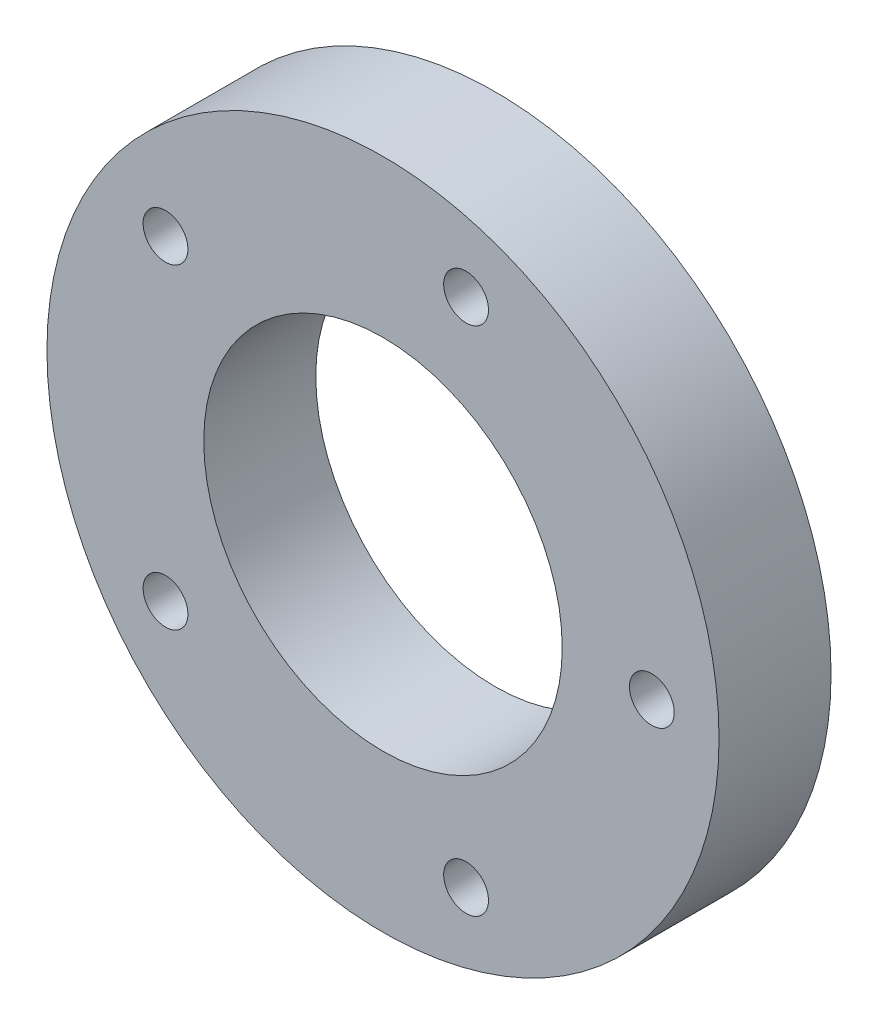
ISO-10303-21;
HEADER;
FILE_DESCRIPTION(('STEP AP214'),'2;1');
FILE_NAME('part.step','',(''),(''),'','','');
FILE_SCHEMA(('AUTOMOTIVE_DESIGN { 1 0 10303 214 1 1 1 1 }'));
ENDSEC;
DATA;
#1=APPLICATION_CONTEXT('core data for automotive mechanical design processes');
#2=APPLICATION_PROTOCOL_DEFINITION('international standard','automotive_design',2000,#1);
#3=PRODUCT_CONTEXT('',#1,'mechanical');
#4=PRODUCT('Part','Part','',(#3));
#5=PRODUCT_RELATED_PRODUCT_CATEGORY('part','',(#4));
#6=PRODUCT_DEFINITION_FORMATION('','',#4);
#7=PRODUCT_DEFINITION_CONTEXT('part definition',#1,'design');
#8=PRODUCT_DEFINITION('design','',#6,#7);
#9=PRODUCT_DEFINITION_SHAPE('','',#8);
#10=(LENGTH_UNIT() NAMED_UNIT(*) SI_UNIT(.MILLI.,.METRE.));
#11=(NAMED_UNIT(*) PLANE_ANGLE_UNIT() SI_UNIT($,.RADIAN.));
#12=(NAMED_UNIT(*) SI_UNIT($,.STERADIAN.) SOLID_ANGLE_UNIT());
#13=UNCERTAINTY_MEASURE_WITH_UNIT(LENGTH_MEASURE(1.E-05),#10,'distance_accuracy_value','');
#14=(GEOMETRIC_REPRESENTATION_CONTEXT(3) GLOBAL_UNCERTAINTY_ASSIGNED_CONTEXT((#13)) GLOBAL_UNIT_ASSIGNED_CONTEXT((#10,
#11,#12)) REPRESENTATION_CONTEXT('',''));
#15=CARTESIAN_POINT('',(0.,0.,0.));
#16=DIRECTION('',(0.,0.,1.));
#17=DIRECTION('',(1.,0.,0.));
#18=AXIS2_PLACEMENT_3D('',#15,#16,#17);
#19=CARTESIAN_POINT('',(0.,0.,-10.));
#20=DIRECTION('',(0.,0.,1.));
#21=DIRECTION('',(1.,0.,0.));
#22=AXIS2_PLACEMENT_3D('',#19,#20,#21);
#23=CYLINDRICAL_SURFACE('',#22,16.);
#24=CARTESIAN_POINT('',(0.,0.,-10.));
#25=DIRECTION('',(0.,0.,1.));
#26=DIRECTION('',(1.,0.,0.));
#27=AXIS2_PLACEMENT_3D('',#24,#25,#26);
#28=CIRCLE('',#27,16.);
#29=CARTESIAN_POINT('',(16.,0.,-10.));
#30=VERTEX_POINT('',#29);
#31=EDGE_CURVE('E41',#30,#30,#28,.T.);
#32=ORIENTED_EDGE('',*,*,#31,.F.);
#33=EDGE_LOOP('',(#32));
#34=FACE_BOUND('',#33,.T.);
#35=CARTESIAN_POINT('',(0.,0.,0.));
#36=DIRECTION('',(0.,0.,1.));
#37=DIRECTION('',(1.,0.,0.));
#38=AXIS2_PLACEMENT_3D('',#35,#36,#37);
#39=CIRCLE('',#38,16.);
#40=CARTESIAN_POINT('',(16.,0.,0.));
#41=VERTEX_POINT('',#40);
#42=EDGE_CURVE('E64',#41,#41,#39,.T.);
#43=ORIENTED_EDGE('',*,*,#42,.T.);
#44=EDGE_LOOP('',(#43));
#45=FACE_BOUND('',#44,.T.);
#46=ADVANCED_FACE('F33',(#34,#45),#23,.F.);
#47=CARTESIAN_POINT('',(7.41640786499874,-22.8253563910837,-10.));
#48=DIRECTION('',(0.,0.,1.));
#49=DIRECTION('',(1.,0.,0.));
#50=AXIS2_PLACEMENT_3D('',#47,#48,#49);
#51=CYLINDRICAL_SURFACE('',#50,2.);
#52=CARTESIAN_POINT('',(7.41640786499874,-22.8253563910837,-10.));
#53=DIRECTION('',(0.,0.,1.));
#54=DIRECTION('',(1.,0.,0.));
#55=AXIS2_PLACEMENT_3D('',#52,#53,#54);
#56=CIRCLE('',#55,2.);
#57=CARTESIAN_POINT('',(9.41640786499874,-22.8253563910837,-10.));
#58=VERTEX_POINT('',#57);
#59=EDGE_CURVE('E46',#58,#58,#56,.T.);
#60=ORIENTED_EDGE('',*,*,#59,.F.);
#61=EDGE_LOOP('',(#60));
#62=FACE_BOUND('',#61,.T.);
#63=CARTESIAN_POINT('',(7.41640786499874,-22.8253563910837,0.));
#64=DIRECTION('',(0.,0.,1.));
#65=DIRECTION('',(1.,0.,0.));
#66=AXIS2_PLACEMENT_3D('',#63,#64,#65);
#67=CIRCLE('',#66,2.);
#68=CARTESIAN_POINT('',(9.41640786499874,-22.8253563910837,0.));
#69=VERTEX_POINT('',#68);
#70=EDGE_CURVE('E62',#69,#69,#67,.T.);
#71=ORIENTED_EDGE('',*,*,#70,.T.);
#72=EDGE_LOOP('',(#71));
#73=FACE_BOUND('',#72,.T.);
#74=ADVANCED_FACE('F91',(#62,#73),#51,.F.);
#75=CARTESIAN_POINT('',(-19.4164078649987,-14.1068460550194,-10.));
#76=DIRECTION('',(0.,0.,1.));
#77=DIRECTION('',(1.,0.,0.));
#78=AXIS2_PLACEMENT_3D('',#75,#76,#77);
#79=CYLINDRICAL_SURFACE('',#78,2.);
#80=CARTESIAN_POINT('',(-19.4164078649987,-14.1068460550194,-10.));
#81=DIRECTION('',(0.,0.,1.));
#82=DIRECTION('',(1.,0.,0.));
#83=AXIS2_PLACEMENT_3D('',#80,#81,#82);
#84=CIRCLE('',#83,2.);
#85=CARTESIAN_POINT('',(-17.4164078649987,-14.1068460550194,-10.));
#86=VERTEX_POINT('',#85);
#87=EDGE_CURVE('E83',#86,#86,#84,.T.);
#88=ORIENTED_EDGE('',*,*,#87,.F.);
#89=EDGE_LOOP('',(#88));
#90=FACE_BOUND('',#89,.T.);
#91=CARTESIAN_POINT('',(-19.4164078649987,-14.1068460550194,0.));
#92=DIRECTION('',(0.,0.,1.));
#93=DIRECTION('',(1.,0.,0.));
#94=AXIS2_PLACEMENT_3D('',#91,#92,#93);
#95=CIRCLE('',#94,2.);
#96=CARTESIAN_POINT('',(-17.4164078649987,-14.1068460550194,0.));
#97=VERTEX_POINT('',#96);
#98=EDGE_CURVE('E59',#97,#97,#95,.T.);
#99=ORIENTED_EDGE('',*,*,#98,.T.);
#100=EDGE_LOOP('',(#99));
#101=FACE_BOUND('',#100,.T.);
#102=ADVANCED_FACE('F94',(#90,#101),#79,.F.);
#103=CARTESIAN_POINT('',(-19.4164078649987,14.1068460550194,-10.));
#104=DIRECTION('',(0.,0.,1.));
#105=DIRECTION('',(1.,0.,0.));
#106=AXIS2_PLACEMENT_3D('',#103,#104,#105);
#107=CYLINDRICAL_SURFACE('',#106,2.);
#108=CARTESIAN_POINT('',(-19.4164078649987,14.1068460550194,-10.));
#109=DIRECTION('',(0.,0.,1.));
#110=DIRECTION('',(1.,0.,0.));
#111=AXIS2_PLACEMENT_3D('',#108,#109,#110);
#112=CIRCLE('',#111,2.);
#113=CARTESIAN_POINT('',(-17.4164078649987,14.1068460550194,-10.));
#114=VERTEX_POINT('',#113);
#115=EDGE_CURVE('E78',#114,#114,#112,.T.);
#116=ORIENTED_EDGE('',*,*,#115,.F.);
#117=EDGE_LOOP('',(#116));
#118=FACE_BOUND('',#117,.T.);
#119=CARTESIAN_POINT('',(-19.4164078649987,14.1068460550194,0.));
#120=DIRECTION('',(0.,0.,1.));
#121=DIRECTION('',(1.,0.,0.));
#122=AXIS2_PLACEMENT_3D('',#119,#120,#121);
#123=CIRCLE('',#122,2.);
#124=CARTESIAN_POINT('',(-17.4164078649987,14.1068460550194,0.));
#125=VERTEX_POINT('',#124);
#126=EDGE_CURVE('E56',#125,#125,#123,.T.);
#127=ORIENTED_EDGE('',*,*,#126,.T.);
#128=EDGE_LOOP('',(#127));
#129=FACE_BOUND('',#128,.T.);
#130=ADVANCED_FACE('F120',(#118,#129),#107,.F.);
#131=CARTESIAN_POINT('',(7.41640786499874,22.8253563910837,-10.));
#132=DIRECTION('',(0.,0.,1.));
#133=DIRECTION('',(1.,0.,0.));
#134=AXIS2_PLACEMENT_3D('',#131,#132,#133);
#135=CYLINDRICAL_SURFACE('',#134,2.);
#136=CARTESIAN_POINT('',(7.41640786499874,22.8253563910837,-10.));
#137=DIRECTION('',(0.,0.,1.));
#138=DIRECTION('',(1.,0.,0.));
#139=AXIS2_PLACEMENT_3D('',#136,#137,#138);
#140=CIRCLE('',#139,2.);
#141=CARTESIAN_POINT('',(9.41640786499874,22.8253563910837,-10.));
#142=VERTEX_POINT('',#141);
#143=EDGE_CURVE('E73',#142,#142,#140,.T.);
#144=ORIENTED_EDGE('',*,*,#143,.F.);
#145=EDGE_LOOP('',(#144));
#146=FACE_BOUND('',#145,.T.);
#147=CARTESIAN_POINT('',(7.41640786499874,22.8253563910837,0.));
#148=DIRECTION('',(0.,0.,1.));
#149=DIRECTION('',(1.,0.,0.));
#150=AXIS2_PLACEMENT_3D('',#147,#148,#149);
#151=CIRCLE('',#150,2.);
#152=CARTESIAN_POINT('',(9.41640786499874,22.8253563910837,0.));
#153=VERTEX_POINT('',#152);
#154=EDGE_CURVE('E53',#153,#153,#151,.T.);
#155=ORIENTED_EDGE('',*,*,#154,.T.);
#156=EDGE_LOOP('',(#155));
#157=FACE_BOUND('',#156,.T.);
#158=ADVANCED_FACE('F123',(#146,#157),#135,.F.);
#159=CARTESIAN_POINT('',(24.,0.,-10.));
#160=DIRECTION('',(0.,0.,1.));
#161=DIRECTION('',(1.,0.,0.));
#162=AXIS2_PLACEMENT_3D('',#159,#160,#161);
#163=CYLINDRICAL_SURFACE('',#162,2.);
#164=CARTESIAN_POINT('',(24.,0.,-10.));
#165=DIRECTION('',(0.,0.,1.));
#166=DIRECTION('',(1.,0.,0.));
#167=AXIS2_PLACEMENT_3D('',#164,#165,#166);
#168=CIRCLE('',#167,2.);
#169=CARTESIAN_POINT('',(26.,0.,-10.));
#170=VERTEX_POINT('',#169);
#171=EDGE_CURVE('E69',#170,#170,#168,.T.);
#172=ORIENTED_EDGE('',*,*,#171,.F.);
#173=EDGE_LOOP('',(#172));
#174=FACE_BOUND('',#173,.T.);
#175=CARTESIAN_POINT('',(24.,0.,0.));
#176=DIRECTION('',(0.,0.,1.));
#177=DIRECTION('',(1.,0.,0.));
#178=AXIS2_PLACEMENT_3D('',#175,#176,#177);
#179=CIRCLE('',#178,2.);
#180=CARTESIAN_POINT('',(26.,0.,0.));
#181=VERTEX_POINT('',#180);
#182=EDGE_CURVE('E50',#181,#181,#179,.T.);
#183=ORIENTED_EDGE('',*,*,#182,.T.);
#184=EDGE_LOOP('',(#183));
#185=FACE_BOUND('',#184,.T.);
#186=ADVANCED_FACE('F35',(#174,#185),#163,.F.);
#187=CARTESIAN_POINT('',(0.,0.,-10.));
#188=DIRECTION('',(0.,0.,1.));
#189=DIRECTION('',(1.,0.,0.));
#190=AXIS2_PLACEMENT_3D('',#187,#188,#189);
#191=CYLINDRICAL_SURFACE('',#190,30.);
#192=CARTESIAN_POINT('',(0.,0.,-10.));
#193=DIRECTION('',(0.,0.,1.));
#194=DIRECTION('',(1.,0.,0.));
#195=AXIS2_PLACEMENT_3D('',#192,#193,#194);
#196=CIRCLE('',#195,30.);
#197=CARTESIAN_POINT('',(30.,0.,-10.));
#198=VERTEX_POINT('',#197);
#199=EDGE_CURVE('E10',#198,#198,#196,.T.);
#200=ORIENTED_EDGE('',*,*,#199,.T.);
#201=EDGE_LOOP('',(#200));
#202=FACE_BOUND('',#201,.T.);
#203=CARTESIAN_POINT('',(0.,0.,0.));
#204=DIRECTION('',(0.,0.,1.));
#205=DIRECTION('',(1.,0.,0.));
#206=AXIS2_PLACEMENT_3D('',#203,#204,#205);
#207=CIRCLE('',#206,30.);
#208=CARTESIAN_POINT('',(30.,0.,0.));
#209=VERTEX_POINT('',#208);
#210=EDGE_CURVE('E37',#209,#209,#207,.T.);
#211=ORIENTED_EDGE('',*,*,#210,.F.);
#212=EDGE_LOOP('',(#211));
#213=FACE_BOUND('',#212,.T.);
#214=ADVANCED_FACE('F106',(#202,#213),#191,.T.);
#215=CARTESIAN_POINT('',(0.,0.,-10.));
#216=DIRECTION('',(0.,0.,1.));
#217=DIRECTION('',(1.,0.,0.));
#218=AXIS2_PLACEMENT_3D('',#215,#216,#217);
#219=PLANE('',#218);
#220=ORIENTED_EDGE('',*,*,#171,.T.);
#221=EDGE_LOOP('',(#220));
#222=FACE_BOUND('',#221,.T.);
#223=ORIENTED_EDGE('',*,*,#143,.T.);
#224=EDGE_LOOP('',(#223));
#225=FACE_BOUND('',#224,.T.);
#226=ORIENTED_EDGE('',*,*,#115,.T.);
#227=EDGE_LOOP('',(#226));
#228=FACE_BOUND('',#227,.T.);
#229=ORIENTED_EDGE('',*,*,#87,.T.);
#230=EDGE_LOOP('',(#229));
#231=FACE_BOUND('',#230,.T.);
#232=ORIENTED_EDGE('',*,*,#59,.T.);
#233=EDGE_LOOP('',(#232));
#234=FACE_BOUND('',#233,.T.);
#235=ORIENTED_EDGE('',*,*,#31,.T.);
#236=EDGE_LOOP('',(#235));
#237=FACE_BOUND('',#236,.T.);
#238=ORIENTED_EDGE('',*,*,#199,.F.);
#239=EDGE_LOOP('',(#238));
#240=FACE_BOUND('',#239,.T.);
#241=ADVANCED_FACE('F88',(#222,#225,#228,#231,#234,#237,#240),#219,.F.);
#242=CARTESIAN_POINT('',(0.,0.,0.));
#243=DIRECTION('',(0.,0.,1.));
#244=DIRECTION('',(1.,0.,0.));
#245=AXIS2_PLACEMENT_3D('',#242,#243,#244);
#246=PLANE('',#245);
#247=ORIENTED_EDGE('',*,*,#182,.F.);
#248=EDGE_LOOP('',(#247));
#249=FACE_BOUND('',#248,.T.);
#250=ORIENTED_EDGE('',*,*,#154,.F.);
#251=EDGE_LOOP('',(#250));
#252=FACE_BOUND('',#251,.T.);
#253=ORIENTED_EDGE('',*,*,#126,.F.);
#254=EDGE_LOOP('',(#253));
#255=FACE_BOUND('',#254,.T.);
#256=ORIENTED_EDGE('',*,*,#98,.F.);
#257=EDGE_LOOP('',(#256));
#258=FACE_BOUND('',#257,.T.);
#259=ORIENTED_EDGE('',*,*,#70,.F.);
#260=EDGE_LOOP('',(#259));
#261=FACE_BOUND('',#260,.T.);
#262=ORIENTED_EDGE('',*,*,#42,.F.);
#263=EDGE_LOOP('',(#262));
#264=FACE_BOUND('',#263,.T.);
#265=ORIENTED_EDGE('',*,*,#210,.T.);
#266=EDGE_LOOP('',(#265));
#267=FACE_BOUND('',#266,.T.);
#268=ADVANCED_FACE('F98',(#249,#252,#255,#258,#261,#264,#267),#246,.T.);
#269=CLOSED_SHELL('',(#46,#74,#102,#130,#158,#186,#214,#241,#268));
#270=MANIFOLD_SOLID_BREP('B2',#269);
#271=ADVANCED_BREP_SHAPE_REPRESENTATION('',(#18,#270),#14);
#272=SHAPE_DEFINITION_REPRESENTATION(#9,#271);
ENDSEC;
END-ISO-10303-21;
